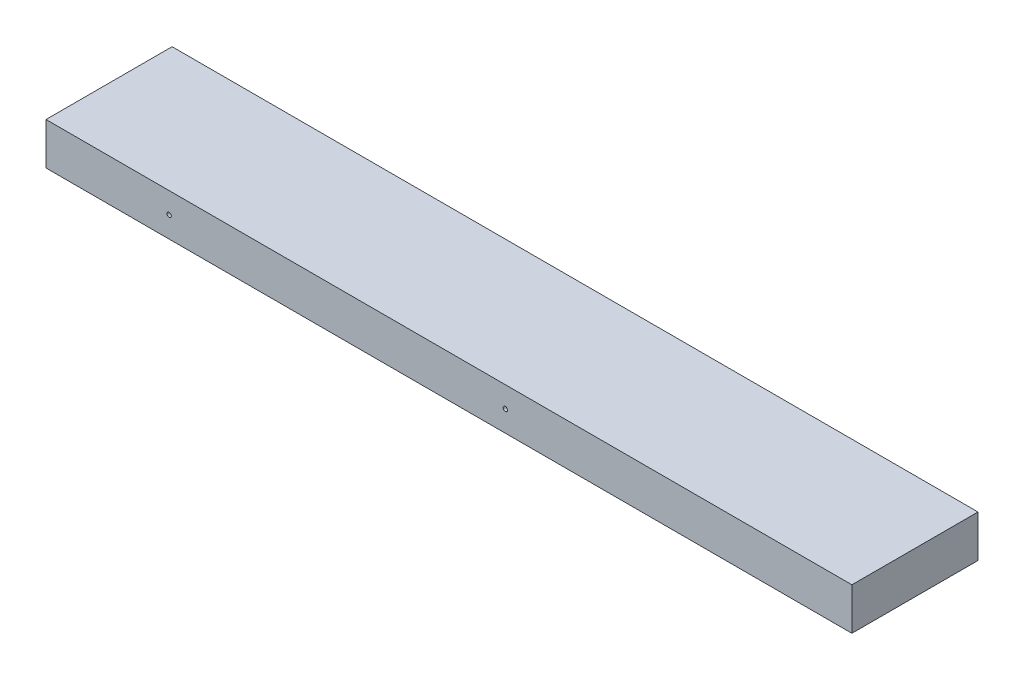
ISO-10303-21;
HEADER;
FILE_DESCRIPTION(('STEP AP214'),'2;1');
FILE_NAME('part.step','',(''),(''),'','','');
FILE_SCHEMA(('AUTOMOTIVE_DESIGN { 1 0 10303 214 1 1 1 1 }'));
ENDSEC;
DATA;
#1=APPLICATION_CONTEXT('core data for automotive mechanical design processes');
#2=APPLICATION_PROTOCOL_DEFINITION('international standard','automotive_design',2000,#1);
#3=PRODUCT_CONTEXT('',#1,'mechanical');
#4=PRODUCT('Part','Part','',(#3));
#5=PRODUCT_RELATED_PRODUCT_CATEGORY('part','',(#4));
#6=PRODUCT_DEFINITION_FORMATION('','',#4);
#7=PRODUCT_DEFINITION_CONTEXT('part definition',#1,'design');
#8=PRODUCT_DEFINITION('design','',#6,#7);
#9=PRODUCT_DEFINITION_SHAPE('','',#8);
#10=(LENGTH_UNIT() NAMED_UNIT(*) SI_UNIT(.MILLI.,.METRE.));
#11=(NAMED_UNIT(*) PLANE_ANGLE_UNIT() SI_UNIT($,.RADIAN.));
#12=(NAMED_UNIT(*) SI_UNIT($,.STERADIAN.) SOLID_ANGLE_UNIT());
#13=UNCERTAINTY_MEASURE_WITH_UNIT(LENGTH_MEASURE(1.E-05),#10,'distance_accuracy_value','');
#14=(GEOMETRIC_REPRESENTATION_CONTEXT(3) GLOBAL_UNCERTAINTY_ASSIGNED_CONTEXT((#13)) GLOBAL_UNIT_ASSIGNED_CONTEXT((#10,
#11,#12)) REPRESENTATION_CONTEXT('',''));
#15=CARTESIAN_POINT('',(0.,0.,0.));
#16=DIRECTION('',(0.,0.,1.));
#17=DIRECTION('',(1.,0.,0.));
#18=AXIS2_PLACEMENT_3D('',#15,#16,#17);
#19=CARTESIAN_POINT('',(86.3599999999995,5213.35,2683.51));
#20=DIRECTION('',(0.,-1.,0.));
#21=DIRECTION('',(0.,0.,-1.));
#22=AXIS2_PLACEMENT_3D('',#19,#20,#21);
#23=PLANE('',#22);
#24=DIRECTION('',(1.,0.,0.));
#25=VECTOR('',#24,1.);
#26=CARTESIAN_POINT('',(265.815570864871,5213.35,2683.51));
#27=LINE('',#26,#25);
#28=CARTESIAN_POINT('',(80.0099999999995,5213.35,2683.51));
#29=VERTEX_POINT('',#28);
#30=CARTESIAN_POINT('',(445.271141729743,5213.35,2683.51));
#31=VERTEX_POINT('',#30);
#32=EDGE_CURVE('E66',#29,#31,#27,.T.);
#33=ORIENTED_EDGE('',*,*,#32,.T.);
#34=DIRECTION('',(0.,0.,-1.));
#35=VECTOR('',#34,1.);
#36=CARTESIAN_POINT('',(445.271141729743,5213.35,2683.51));
#37=LINE('',#36,#35);
#38=CARTESIAN_POINT('',(445.271141729743,5213.35,2740.66));
#39=VERTEX_POINT('',#38);
#40=EDGE_CURVE('E141',#39,#31,#37,.T.);
#41=ORIENTED_EDGE('',*,*,#40,.F.);
#42=DIRECTION('',(-1.,0.,0.));
#43=VECTOR('',#42,1.);
#44=CARTESIAN_POINT('',(265.815570864871,5213.35,2740.66));
#45=LINE('',#44,#43);
#46=CARTESIAN_POINT('',(80.0099999999995,5213.35,2740.66));
#47=VERTEX_POINT('',#46);
#48=EDGE_CURVE('E71',#39,#47,#45,.T.);
#49=ORIENTED_EDGE('',*,*,#48,.T.);
#50=DIRECTION('',(0.,0.,1.));
#51=VECTOR('',#50,1.);
#52=CARTESIAN_POINT('',(80.0099999999995,5213.35,2683.51));
#53=LINE('',#52,#51);
#54=EDGE_CURVE('E132',#29,#47,#53,.T.);
#55=ORIENTED_EDGE('',*,*,#54,.F.);
#56=EDGE_LOOP('',(#33,#41,#49,#55));
#57=FACE_BOUND('',#56,.T.);
#58=ADVANCED_FACE('F35',(#57),#23,.T.);
#59=CARTESIAN_POINT('',(265.815570864871,5222.875,2740.66));
#60=DIRECTION('',(0.,0.,-1.));
#61=DIRECTION('',(-1.,0.,0.));
#62=AXIS2_PLACEMENT_3D('',#59,#60,#61);
#63=PLANE('',#62);
#64=CARTESIAN_POINT('',(135.802759022741,5222.875,2740.66));
#65=DIRECTION('',(0.,0.,-1.));
#66=DIRECTION('',(-1.,0.,0.));
#67=AXIS2_PLACEMENT_3D('',#64,#65,#66);
#68=CIRCLE('',#67,0.991870000000006);
#69=CARTESIAN_POINT('',(134.810889022741,5222.875,2740.66));
#70=VERTEX_POINT('',#69);
#71=EDGE_CURVE('E38',#70,#70,#68,.T.);
#72=ORIENTED_EDGE('',*,*,#71,.T.);
#73=EDGE_LOOP('',(#72));
#74=FACE_BOUND('',#73,.T.);
#75=CARTESIAN_POINT('',(288.202759022741,5222.875,2740.66));
#76=DIRECTION('',(0.,0.,-1.));
#77=DIRECTION('',(-1.,0.,0.));
#78=AXIS2_PLACEMENT_3D('',#75,#76,#77);
#79=CIRCLE('',#78,0.991870000000006);
#80=CARTESIAN_POINT('',(287.210889022741,5222.875,2740.66));
#81=VERTEX_POINT('',#80);
#82=EDGE_CURVE('E113',#81,#81,#79,.T.);
#83=ORIENTED_EDGE('',*,*,#82,.T.);
#84=EDGE_LOOP('',(#83));
#85=FACE_BOUND('',#84,.T.);
#86=DIRECTION('',(1.,0.,0.));
#87=VECTOR('',#86,1.);
#88=CARTESIAN_POINT('',(445.271141729743,5232.4,2740.66));
#89=LINE('',#88,#87);
#90=CARTESIAN_POINT('',(80.0099999999995,5232.4,2740.66));
#91=VERTEX_POINT('',#90);
#92=CARTESIAN_POINT('',(445.271141729743,5232.4,2740.66));
#93=VERTEX_POINT('',#92);
#94=EDGE_CURVE('E75',#91,#93,#89,.T.);
#95=ORIENTED_EDGE('',*,*,#94,.F.);
#96=DIRECTION('',(0.,1.,0.));
#97=VECTOR('',#96,1.);
#98=CARTESIAN_POINT('',(80.0099999999995,5213.35,2740.66));
#99=LINE('',#98,#97);
#100=EDGE_CURVE('E134',#47,#91,#99,.T.);
#101=ORIENTED_EDGE('',*,*,#100,.F.);
#102=ORIENTED_EDGE('',*,*,#48,.F.);
#103=DIRECTION('',(0.,1.,0.));
#104=VECTOR('',#103,1.);
#105=CARTESIAN_POINT('',(445.271141729743,5213.35,2740.66));
#106=LINE('',#105,#104);
#107=EDGE_CURVE('E143',#93,#39,#106,.F.);
#108=ORIENTED_EDGE('',*,*,#107,.F.);
#109=EDGE_LOOP('',(#95,#101,#102,#108));
#110=FACE_BOUND('',#109,.T.);
#111=ADVANCED_FACE('F155',(#74,#85,#110),#63,.F.);
#112=CARTESIAN_POINT('',(445.271141729743,5213.35,2683.51));
#113=DIRECTION('',(1.,0.,0.));
#114=DIRECTION('',(0.,0.,-1.));
#115=AXIS2_PLACEMENT_3D('',#112,#113,#114);
#116=PLANE('',#115);
#117=DIRECTION('',(0.,1.,0.));
#118=VECTOR('',#117,1.);
#119=CARTESIAN_POINT('',(445.271141729743,5222.875,2683.51));
#120=LINE('',#119,#118);
#121=CARTESIAN_POINT('',(445.271141729743,5232.4,2683.51));
#122=VERTEX_POINT('',#121);
#123=EDGE_CURVE('E53',#31,#122,#120,.T.);
#124=ORIENTED_EDGE('',*,*,#123,.T.);
#125=DIRECTION('',(0.,0.,1.));
#126=VECTOR('',#125,1.);
#127=CARTESIAN_POINT('',(445.271141729743,5232.4,2683.51));
#128=LINE('',#127,#126);
#129=EDGE_CURVE('E44',#93,#122,#128,.F.);
#130=ORIENTED_EDGE('',*,*,#129,.F.);
#131=ORIENTED_EDGE('',*,*,#107,.T.);
#132=ORIENTED_EDGE('',*,*,#40,.T.);
#133=EDGE_LOOP('',(#124,#130,#131,#132));
#134=FACE_BOUND('',#133,.T.);
#135=ADVANCED_FACE('F186',(#134),#116,.T.);
#136=CARTESIAN_POINT('',(265.815570864871,5222.875,2683.51));
#137=DIRECTION('',(0.,0.,1.));
#138=DIRECTION('',(1.,0.,0.));
#139=AXIS2_PLACEMENT_3D('',#136,#137,#138);
#140=PLANE('',#139);
#141=CARTESIAN_POINT('',(415.202759022741,5222.875,2683.51));
#142=DIRECTION('',(0.,0.,1.));
#143=DIRECTION('',(1.,0.,0.));
#144=AXIS2_PLACEMENT_3D('',#141,#142,#143);
#145=CIRCLE('',#144,0.991870000000006);
#146=CARTESIAN_POINT('',(416.194629022741,5222.875,2683.51));
#147=VERTEX_POINT('',#146);
#148=EDGE_CURVE('E117',#147,#147,#145,.T.);
#149=ORIENTED_EDGE('',*,*,#148,.T.);
#150=EDGE_LOOP('',(#149));
#151=FACE_BOUND('',#150,.T.);
#152=CARTESIAN_POINT('',(313.602759022741,5222.875,2683.51));
#153=DIRECTION('',(0.,0.,1.));
#154=DIRECTION('',(1.,0.,0.));
#155=AXIS2_PLACEMENT_3D('',#152,#153,#154);
#156=CIRCLE('',#155,0.991870000000006);
#157=CARTESIAN_POINT('',(314.594629022741,5222.875,2683.51));
#158=VERTEX_POINT('',#157);
#159=EDGE_CURVE('E121',#158,#158,#156,.T.);
#160=ORIENTED_EDGE('',*,*,#159,.T.);
#161=EDGE_LOOP('',(#160));
#162=FACE_BOUND('',#161,.T.);
#163=CARTESIAN_POINT('',(110.402759022741,5222.875,2683.51));
#164=DIRECTION('',(0.,0.,1.));
#165=DIRECTION('',(1.,0.,0.));
#166=AXIS2_PLACEMENT_3D('',#163,#164,#165);
#167=CIRCLE('',#166,0.991870000000006);
#168=CARTESIAN_POINT('',(111.394629022741,5222.875,2683.51));
#169=VERTEX_POINT('',#168);
#170=EDGE_CURVE('E125',#169,#169,#167,.T.);
#171=ORIENTED_EDGE('',*,*,#170,.T.);
#172=EDGE_LOOP('',(#171));
#173=FACE_BOUND('',#172,.T.);
#174=ORIENTED_EDGE('',*,*,#123,.F.);
#175=ORIENTED_EDGE('',*,*,#32,.F.);
#176=DIRECTION('',(0.,-1.,0.));
#177=VECTOR('',#176,1.);
#178=CARTESIAN_POINT('',(80.0099999999995,5232.4,2683.51));
#179=LINE('',#178,#177);
#180=CARTESIAN_POINT('',(80.0099999999995,5232.4,2683.51));
#181=VERTEX_POINT('',#180);
#182=EDGE_CURVE('E129',#181,#29,#179,.T.);
#183=ORIENTED_EDGE('',*,*,#182,.F.);
#184=DIRECTION('',(1.,0.,0.));
#185=VECTOR('',#184,1.);
#186=CARTESIAN_POINT('',(445.271141729743,5232.4,2683.51));
#187=LINE('',#186,#185);
#188=EDGE_CURVE('E11',#122,#181,#187,.F.);
#189=ORIENTED_EDGE('',*,*,#188,.F.);
#190=EDGE_LOOP('',(#174,#175,#183,#189));
#191=FACE_BOUND('',#190,.T.);
#192=ADVANCED_FACE('F176',(#151,#162,#173,#191),#140,.F.);
#193=CARTESIAN_POINT('',(445.271141729743,5232.4,2683.51));
#194=DIRECTION('',(0.,1.,0.));
#195=DIRECTION('',(0.,0.,1.));
#196=AXIS2_PLACEMENT_3D('',#193,#194,#195);
#197=PLANE('',#196);
#198=ORIENTED_EDGE('',*,*,#188,.T.);
#199=DIRECTION('',(0.,0.,-1.));
#200=VECTOR('',#199,1.);
#201=CARTESIAN_POINT('',(80.0099999999995,5232.4,2740.66));
#202=LINE('',#201,#200);
#203=EDGE_CURVE('E126',#91,#181,#202,.T.);
#204=ORIENTED_EDGE('',*,*,#203,.F.);
#205=ORIENTED_EDGE('',*,*,#94,.T.);
#206=ORIENTED_EDGE('',*,*,#129,.T.);
#207=EDGE_LOOP('',(#198,#204,#205,#206));
#208=FACE_BOUND('',#207,.T.);
#209=ADVANCED_FACE('F173',(#208),#197,.T.);
#210=CARTESIAN_POINT('',(80.0099999999995,0.,0.));
#211=DIRECTION('',(-1.,0.,0.));
#212=DIRECTION('',(0.,0.,1.));
#213=AXIS2_PLACEMENT_3D('',#210,#211,#212);
#214=PLANE('',#213);
#215=ORIENTED_EDGE('',*,*,#203,.T.);
#216=ORIENTED_EDGE('',*,*,#182,.T.);
#217=ORIENTED_EDGE('',*,*,#54,.T.);
#218=ORIENTED_EDGE('',*,*,#100,.T.);
#219=EDGE_LOOP('',(#215,#216,#217,#218));
#220=FACE_BOUND('',#219,.T.);
#221=ADVANCED_FACE('F175',(#220),#214,.T.);
#222=CARTESIAN_POINT('',(110.402759022741,5222.875,2664.46));
#223=DIRECTION('',(0.,0.,-1.));
#224=DIRECTION('',(-1.,0.,0.));
#225=AXIS2_PLACEMENT_3D('',#222,#223,#224);
#226=CYLINDRICAL_SURFACE('',#225,0.991870000000006);
#227=CARTESIAN_POINT('',(110.402759022741,5222.875,2702.56));
#228=DIRECTION('',(0.,0.,-1.));
#229=DIRECTION('',(-1.,0.,0.));
#230=AXIS2_PLACEMENT_3D('',#227,#228,#229);
#231=CIRCLE('',#230,0.991870000000006);
#232=CARTESIAN_POINT('',(109.410889022741,5222.875,2702.56));
#233=VERTEX_POINT('',#232);
#234=EDGE_CURVE('E122',#233,#233,#231,.T.);
#235=ORIENTED_EDGE('',*,*,#234,.F.);
#236=EDGE_LOOP('',(#235));
#237=FACE_BOUND('',#236,.T.);
#238=ORIENTED_EDGE('',*,*,#170,.F.);
#239=EDGE_LOOP('',(#238));
#240=FACE_BOUND('',#239,.T.);
#241=ADVANCED_FACE('F183',(#237,#240),#226,.F.);
#242=CARTESIAN_POINT('',(110.402759022741,5222.875,2702.56));
#243=DIRECTION('',(0.,0.,-1.));
#244=DIRECTION('',(-1.,0.,0.));
#245=AXIS2_PLACEMENT_3D('',#242,#243,#244);
#246=CONICAL_SURFACE('',#245,0.991870000000006,1.02974425867677);
#247=CARTESIAN_POINT('',(110.402759022741,5222.875,2703.1559756222));
#248=VERTEX_POINT('',#247);
#249=VERTEX_LOOP('',#248);
#250=FACE_BOUND('',#249,.T.);
#251=ORIENTED_EDGE('',*,*,#234,.T.);
#252=EDGE_LOOP('',(#251));
#253=FACE_BOUND('',#252,.T.);
#254=ADVANCED_FACE('F252',(#250,#253),#246,.F.);
#255=CARTESIAN_POINT('',(313.602759022741,5222.875,2664.46));
#256=DIRECTION('',(0.,0.,-1.));
#257=DIRECTION('',(-1.,0.,0.));
#258=AXIS2_PLACEMENT_3D('',#255,#256,#257);
#259=CYLINDRICAL_SURFACE('',#258,0.991870000000006);
#260=CARTESIAN_POINT('',(313.602759022741,5222.875,2702.56));
#261=DIRECTION('',(0.,0.,-1.));
#262=DIRECTION('',(-1.,0.,0.));
#263=AXIS2_PLACEMENT_3D('',#260,#261,#262);
#264=CIRCLE('',#263,0.991870000000006);
#265=CARTESIAN_POINT('',(312.610889022741,5222.875,2702.56));
#266=VERTEX_POINT('',#265);
#267=EDGE_CURVE('E118',#266,#266,#264,.T.);
#268=ORIENTED_EDGE('',*,*,#267,.F.);
#269=EDGE_LOOP('',(#268));
#270=FACE_BOUND('',#269,.T.);
#271=ORIENTED_EDGE('',*,*,#159,.F.);
#272=EDGE_LOOP('',(#271));
#273=FACE_BOUND('',#272,.T.);
#274=ADVANCED_FACE('F243',(#270,#273),#259,.F.);
#275=CARTESIAN_POINT('',(313.602759022741,5222.875,2702.56));
#276=DIRECTION('',(0.,0.,-1.));
#277=DIRECTION('',(-1.,0.,0.));
#278=AXIS2_PLACEMENT_3D('',#275,#276,#277);
#279=CONICAL_SURFACE('',#278,0.991870000000006,1.02974425867677);
#280=CARTESIAN_POINT('',(313.602759022741,5222.875,2703.1559756222));
#281=VERTEX_POINT('',#280);
#282=VERTEX_LOOP('',#281);
#283=FACE_BOUND('',#282,.T.);
#284=ORIENTED_EDGE('',*,*,#267,.T.);
#285=EDGE_LOOP('',(#284));
#286=FACE_BOUND('',#285,.T.);
#287=ADVANCED_FACE('F234',(#283,#286),#279,.F.);
#288=CARTESIAN_POINT('',(415.202759022741,5222.875,2664.46));
#289=DIRECTION('',(0.,0.,-1.));
#290=DIRECTION('',(-1.,0.,0.));
#291=AXIS2_PLACEMENT_3D('',#288,#289,#290);
#292=CYLINDRICAL_SURFACE('',#291,0.991870000000006);
#293=CARTESIAN_POINT('',(415.202759022741,5222.875,2702.56));
#294=DIRECTION('',(0.,0.,-1.));
#295=DIRECTION('',(-1.,0.,0.));
#296=AXIS2_PLACEMENT_3D('',#293,#294,#295);
#297=CIRCLE('',#296,0.991870000000006);
#298=CARTESIAN_POINT('',(414.210889022741,5222.875,2702.56));
#299=VERTEX_POINT('',#298);
#300=EDGE_CURVE('E114',#299,#299,#297,.T.);
#301=ORIENTED_EDGE('',*,*,#300,.F.);
#302=EDGE_LOOP('',(#301));
#303=FACE_BOUND('',#302,.T.);
#304=ORIENTED_EDGE('',*,*,#148,.F.);
#305=EDGE_LOOP('',(#304));
#306=FACE_BOUND('',#305,.T.);
#307=ADVANCED_FACE('F169',(#303,#306),#292,.F.);
#308=CARTESIAN_POINT('',(415.202759022741,5222.875,2702.56));
#309=DIRECTION('',(0.,0.,-1.));
#310=DIRECTION('',(-1.,0.,0.));
#311=AXIS2_PLACEMENT_3D('',#308,#309,#310);
#312=CONICAL_SURFACE('',#311,0.991870000000006,1.02974425867677);
#313=CARTESIAN_POINT('',(415.202759022741,5222.875,2703.1559756222));
#314=VERTEX_POINT('',#313);
#315=VERTEX_LOOP('',#314);
#316=FACE_BOUND('',#315,.T.);
#317=ORIENTED_EDGE('',*,*,#300,.T.);
#318=EDGE_LOOP('',(#317));
#319=FACE_BOUND('',#318,.T.);
#320=ADVANCED_FACE('F160',(#316,#319),#312,.F.);
#321=CARTESIAN_POINT('',(288.202759022741,5222.875,2759.71000000001));
#322=DIRECTION('',(0.,0.,1.));
#323=DIRECTION('',(1.,0.,0.));
#324=AXIS2_PLACEMENT_3D('',#321,#322,#323);
#325=CYLINDRICAL_SURFACE('',#324,0.991870000000006);
#326=CARTESIAN_POINT('',(288.202759022741,5222.875,2721.61000000001));
#327=DIRECTION('',(0.,0.,1.));
#328=DIRECTION('',(1.,0.,0.));
#329=AXIS2_PLACEMENT_3D('',#326,#327,#328);
#330=CIRCLE('',#329,0.991870000000006);
#331=CARTESIAN_POINT('',(289.194629022741,5222.875,2721.61000000001));
#332=VERTEX_POINT('',#331);
#333=EDGE_CURVE('E109',#332,#332,#330,.T.);
#334=ORIENTED_EDGE('',*,*,#333,.F.);
#335=EDGE_LOOP('',(#334));
#336=FACE_BOUND('',#335,.T.);
#337=ORIENTED_EDGE('',*,*,#82,.F.);
#338=EDGE_LOOP('',(#337));
#339=FACE_BOUND('',#338,.T.);
#340=ADVANCED_FACE('F157',(#336,#339),#325,.F.);
#341=CARTESIAN_POINT('',(288.202759022741,5222.875,2721.61000000001));
#342=DIRECTION('',(0.,0.,1.));
#343=DIRECTION('',(1.,0.,0.));
#344=AXIS2_PLACEMENT_3D('',#341,#342,#343);
#345=CONICAL_SURFACE('',#344,0.991870000000006,1.02974425867677);
#346=CARTESIAN_POINT('',(288.202759022741,5222.875,2721.01402437781));
#347=VERTEX_POINT('',#346);
#348=VERTEX_LOOP('',#347);
#349=FACE_BOUND('',#348,.T.);
#350=ORIENTED_EDGE('',*,*,#333,.T.);
#351=EDGE_LOOP('',(#350));
#352=FACE_BOUND('',#351,.T.);
#353=ADVANCED_FACE('F159',(#349,#352),#345,.F.);
#354=CARTESIAN_POINT('',(135.802759022741,5222.875,2759.71000000001));
#355=DIRECTION('',(0.,0.,1.));
#356=DIRECTION('',(1.,0.,0.));
#357=AXIS2_PLACEMENT_3D('',#354,#355,#356);
#358=CYLINDRICAL_SURFACE('',#357,0.991870000000006);
#359=CARTESIAN_POINT('',(135.802759022741,5222.875,2721.61000000001));
#360=DIRECTION('',(0.,0.,1.));
#361=DIRECTION('',(1.,0.,0.));
#362=AXIS2_PLACEMENT_3D('',#359,#360,#361);
#363=CIRCLE('',#362,0.991870000000006);
#364=CARTESIAN_POINT('',(136.794629022741,5222.875,2721.61000000001));
#365=VERTEX_POINT('',#364);
#366=EDGE_CURVE('E105',#365,#365,#363,.T.);
#367=ORIENTED_EDGE('',*,*,#366,.F.);
#368=EDGE_LOOP('',(#367));
#369=FACE_BOUND('',#368,.T.);
#370=ORIENTED_EDGE('',*,*,#71,.F.);
#371=EDGE_LOOP('',(#370));
#372=FACE_BOUND('',#371,.T.);
#373=ADVANCED_FACE('F101',(#369,#372),#358,.F.);
#374=CARTESIAN_POINT('',(135.802759022741,5222.875,2721.61000000001));
#375=DIRECTION('',(0.,0.,1.));
#376=DIRECTION('',(1.,0.,0.));
#377=AXIS2_PLACEMENT_3D('',#374,#375,#376);
#378=CONICAL_SURFACE('',#377,0.991870000000006,1.02974425867677);
#379=CARTESIAN_POINT('',(135.802759022741,5222.875,2721.01402437781));
#380=VERTEX_POINT('',#379);
#381=VERTEX_LOOP('',#380);
#382=FACE_BOUND('',#381,.T.);
#383=ORIENTED_EDGE('',*,*,#366,.T.);
#384=EDGE_LOOP('',(#383));
#385=FACE_BOUND('',#384,.T.);
#386=ADVANCED_FACE('F98',(#382,#385),#378,.F.);
#387=CLOSED_SHELL('',(#58,#111,#135,#192,#209,#221,#241,#254,#274,#287,#307,#320,#340,#353,#373,#386));
#388=MANIFOLD_SOLID_BREP('B2',#387);
#389=ADVANCED_BREP_SHAPE_REPRESENTATION('',(#18,#388),#14);
#390=SHAPE_DEFINITION_REPRESENTATION(#9,#389);
ENDSEC;
END-ISO-10303-21;
